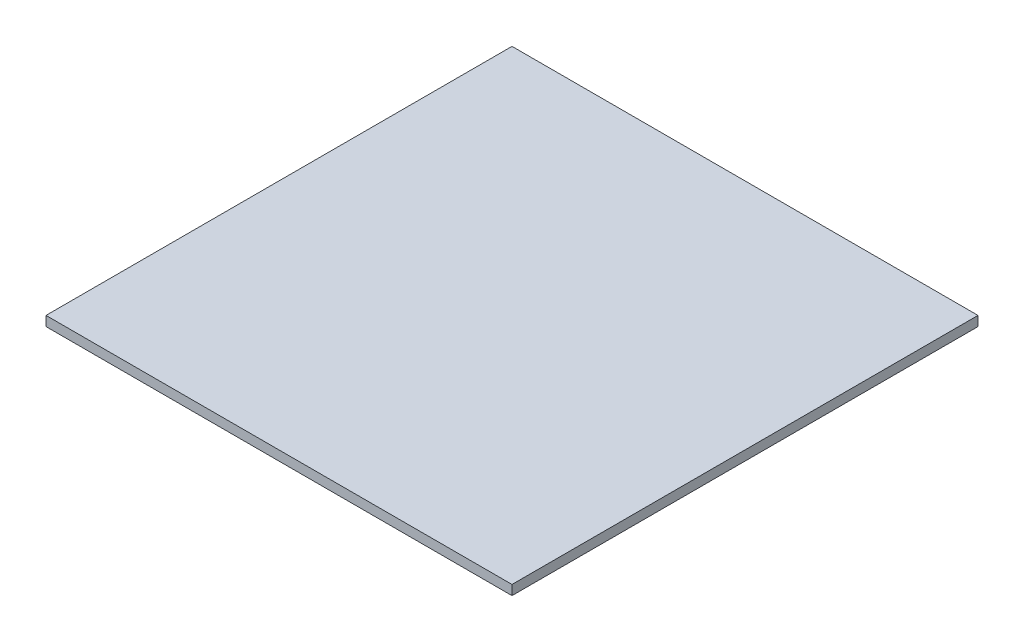
ISO-10303-21;
HEADER;
FILE_DESCRIPTION(('STEP AP214'),'2;1');
FILE_NAME('part.step','',(''),(''),'','','');
FILE_SCHEMA(('AUTOMOTIVE_DESIGN { 1 0 10303 214 1 1 1 1 }'));
ENDSEC;
DATA;
#1=APPLICATION_CONTEXT('core data for automotive mechanical design processes');
#2=APPLICATION_PROTOCOL_DEFINITION('international standard','automotive_design',2000,#1);
#3=PRODUCT_CONTEXT('',#1,'mechanical');
#4=PRODUCT('Part','Part','',(#3));
#5=PRODUCT_RELATED_PRODUCT_CATEGORY('part','',(#4));
#6=PRODUCT_DEFINITION_FORMATION('','',#4);
#7=PRODUCT_DEFINITION_CONTEXT('part definition',#1,'design');
#8=PRODUCT_DEFINITION('design','',#6,#7);
#9=PRODUCT_DEFINITION_SHAPE('','',#8);
#10=(LENGTH_UNIT() NAMED_UNIT(*) SI_UNIT(.MILLI.,.METRE.));
#11=(NAMED_UNIT(*) PLANE_ANGLE_UNIT() SI_UNIT($,.RADIAN.));
#12=(NAMED_UNIT(*) SI_UNIT($,.STERADIAN.) SOLID_ANGLE_UNIT());
#13=UNCERTAINTY_MEASURE_WITH_UNIT(LENGTH_MEASURE(1.E-05),#10,'distance_accuracy_value','');
#14=(GEOMETRIC_REPRESENTATION_CONTEXT(3) GLOBAL_UNCERTAINTY_ASSIGNED_CONTEXT((#13)) GLOBAL_UNIT_ASSIGNED_CONTEXT((#10,
#11,#12)) REPRESENTATION_CONTEXT('',''));
#15=CARTESIAN_POINT('',(0.,0.,0.));
#16=DIRECTION('',(0.,0.,1.));
#17=DIRECTION('',(1.,0.,0.));
#18=AXIS2_PLACEMENT_3D('',#15,#16,#17);
#19=CARTESIAN_POINT('',(152.4,3.175,152.4));
#20=DIRECTION('',(-1.,0.,0.));
#21=DIRECTION('',(0.,0.,1.));
#22=AXIS2_PLACEMENT_3D('',#19,#20,#21);
#23=PLANE('',#22);
#24=DIRECTION('',(0.,0.,-1.));
#25=VECTOR('',#24,1.);
#26=CARTESIAN_POINT('',(152.4,-3.175,152.4));
#27=LINE('',#26,#25);
#28=CARTESIAN_POINT('',(152.4,-3.175,152.4));
#29=VERTEX_POINT('',#28);
#30=CARTESIAN_POINT('',(152.4,-3.175,-152.4));
#31=VERTEX_POINT('',#30);
#32=EDGE_CURVE('E96',#29,#31,#27,.T.);
#33=ORIENTED_EDGE('',*,*,#32,.T.);
#34=DIRECTION('',(0.,-1.,0.));
#35=VECTOR('',#34,1.);
#36=CARTESIAN_POINT('',(152.4,3.175,-152.4));
#37=LINE('',#36,#35);
#38=CARTESIAN_POINT('',(152.4,3.175,-152.4));
#39=VERTEX_POINT('',#38);
#40=EDGE_CURVE('E11',#39,#31,#37,.T.);
#41=ORIENTED_EDGE('',*,*,#40,.F.);
#42=DIRECTION('',(0.,0.,-1.));
#43=VECTOR('',#42,1.);
#44=CARTESIAN_POINT('',(152.4,3.175,152.4));
#45=LINE('',#44,#43);
#46=CARTESIAN_POINT('',(152.4,3.175,152.4));
#47=VERTEX_POINT('',#46);
#48=EDGE_CURVE('E84',#47,#39,#45,.T.);
#49=ORIENTED_EDGE('',*,*,#48,.F.);
#50=DIRECTION('',(0.,-1.,0.));
#51=VECTOR('',#50,1.);
#52=CARTESIAN_POINT('',(152.4,3.175,152.4));
#53=LINE('',#52,#51);
#54=EDGE_CURVE('E92',#47,#29,#53,.T.);
#55=ORIENTED_EDGE('',*,*,#54,.T.);
#56=EDGE_LOOP('',(#33,#41,#49,#55));
#57=FACE_BOUND('',#56,.T.);
#58=ADVANCED_FACE('F33',(#57),#23,.F.);
#59=CARTESIAN_POINT('',(-152.4,3.175,-152.4));
#60=DIRECTION('',(0.,0.,1.));
#61=DIRECTION('',(1.,0.,0.));
#62=AXIS2_PLACEMENT_3D('',#59,#60,#61);
#63=PLANE('',#62);
#64=DIRECTION('',(-1.,0.,0.));
#65=VECTOR('',#64,1.);
#66=CARTESIAN_POINT('',(-152.4,-3.175,-152.4));
#67=LINE('',#66,#65);
#68=CARTESIAN_POINT('',(-152.4,-3.175,-152.4));
#69=VERTEX_POINT('',#68);
#70=EDGE_CURVE('E88',#31,#69,#67,.T.);
#71=ORIENTED_EDGE('',*,*,#70,.T.);
#72=DIRECTION('',(0.,-1.,0.));
#73=VECTOR('',#72,1.);
#74=CARTESIAN_POINT('',(-152.4,3.175,-152.4));
#75=LINE('',#74,#73);
#76=CARTESIAN_POINT('',(-152.4,3.175,-152.4));
#77=VERTEX_POINT('',#76);
#78=EDGE_CURVE('E41',#77,#69,#75,.T.);
#79=ORIENTED_EDGE('',*,*,#78,.F.);
#80=DIRECTION('',(-1.,0.,0.));
#81=VECTOR('',#80,1.);
#82=CARTESIAN_POINT('',(-152.4,3.175,-152.4));
#83=LINE('',#82,#81);
#84=EDGE_CURVE('E79',#39,#77,#83,.T.);
#85=ORIENTED_EDGE('',*,*,#84,.F.);
#86=ORIENTED_EDGE('',*,*,#40,.T.);
#87=EDGE_LOOP('',(#71,#79,#85,#86));
#88=FACE_BOUND('',#87,.T.);
#89=ADVANCED_FACE('F87',(#88),#63,.F.);
#90=CARTESIAN_POINT('',(-152.4,3.175,152.4));
#91=DIRECTION('',(1.,0.,0.));
#92=DIRECTION('',(0.,0.,-1.));
#93=AXIS2_PLACEMENT_3D('',#90,#91,#92);
#94=PLANE('',#93);
#95=DIRECTION('',(0.,0.,1.));
#96=VECTOR('',#95,1.);
#97=CARTESIAN_POINT('',(-152.4,-3.175,152.4));
#98=LINE('',#97,#96);
#99=CARTESIAN_POINT('',(-152.4,-3.175,152.4));
#100=VERTEX_POINT('',#99);
#101=EDGE_CURVE('E66',#69,#100,#98,.T.);
#102=ORIENTED_EDGE('',*,*,#101,.T.);
#103=DIRECTION('',(0.,-1.,0.));
#104=VECTOR('',#103,1.);
#105=CARTESIAN_POINT('',(-152.4,3.175,152.4));
#106=LINE('',#105,#104);
#107=CARTESIAN_POINT('',(-152.4,3.175,152.4));
#108=VERTEX_POINT('',#107);
#109=EDGE_CURVE('E89',#108,#100,#106,.T.);
#110=ORIENTED_EDGE('',*,*,#109,.F.);
#111=DIRECTION('',(0.,0.,1.));
#112=VECTOR('',#111,1.);
#113=CARTESIAN_POINT('',(-152.4,3.175,152.4));
#114=LINE('',#113,#112);
#115=EDGE_CURVE('E82',#77,#108,#114,.T.);
#116=ORIENTED_EDGE('',*,*,#115,.F.);
#117=ORIENTED_EDGE('',*,*,#78,.T.);
#118=EDGE_LOOP('',(#102,#110,#116,#117));
#119=FACE_BOUND('',#118,.T.);
#120=ADVANCED_FACE('F90',(#119),#94,.F.);
#121=CARTESIAN_POINT('',(-152.4,3.175,152.4));
#122=DIRECTION('',(0.,0.,-1.));
#123=DIRECTION('',(-1.,0.,0.));
#124=AXIS2_PLACEMENT_3D('',#121,#122,#123);
#125=PLANE('',#124);
#126=DIRECTION('',(1.,0.,0.));
#127=VECTOR('',#126,1.);
#128=CARTESIAN_POINT('',(-152.4,-3.175,152.4));
#129=LINE('',#128,#127);
#130=EDGE_CURVE('E72',#100,#29,#129,.T.);
#131=ORIENTED_EDGE('',*,*,#130,.T.);
#132=ORIENTED_EDGE('',*,*,#54,.F.);
#133=DIRECTION('',(1.,0.,0.));
#134=VECTOR('',#133,1.);
#135=CARTESIAN_POINT('',(-152.4,3.175,152.4));
#136=LINE('',#135,#134);
#137=EDGE_CURVE('E49',#108,#47,#136,.T.);
#138=ORIENTED_EDGE('',*,*,#137,.F.);
#139=ORIENTED_EDGE('',*,*,#109,.T.);
#140=EDGE_LOOP('',(#131,#132,#138,#139));
#141=FACE_BOUND('',#140,.T.);
#142=ADVANCED_FACE('F103',(#141),#125,.F.);
#143=CARTESIAN_POINT('',(0.,3.175,0.));
#144=DIRECTION('',(0.,-1.,0.));
#145=DIRECTION('',(0.,0.,-1.));
#146=AXIS2_PLACEMENT_3D('',#143,#144,#145);
#147=PLANE('',#146);
#148=ORIENTED_EDGE('',*,*,#48,.T.);
#149=ORIENTED_EDGE('',*,*,#84,.T.);
#150=ORIENTED_EDGE('',*,*,#115,.T.);
#151=ORIENTED_EDGE('',*,*,#137,.T.);
#152=EDGE_LOOP('',(#148,#149,#150,#151));
#153=FACE_BOUND('',#152,.T.);
#154=ADVANCED_FACE('F80',(#153),#147,.F.);
#155=CARTESIAN_POINT('',(0.,-3.175,0.));
#156=DIRECTION('',(0.,-1.,0.));
#157=DIRECTION('',(0.,0.,-1.));
#158=AXIS2_PLACEMENT_3D('',#155,#156,#157);
#159=PLANE('',#158);
#160=ORIENTED_EDGE('',*,*,#32,.F.);
#161=ORIENTED_EDGE('',*,*,#130,.F.);
#162=ORIENTED_EDGE('',*,*,#101,.F.);
#163=ORIENTED_EDGE('',*,*,#70,.F.);
#164=EDGE_LOOP('',(#160,#161,#162,#163));
#165=FACE_BOUND('',#164,.T.);
#166=ADVANCED_FACE('F106',(#165),#159,.T.);
#167=CLOSED_SHELL('',(#58,#89,#120,#142,#154,#166));
#168=MANIFOLD_SOLID_BREP('B2',#167);
#169=ADVANCED_BREP_SHAPE_REPRESENTATION('',(#18,#168),#14);
#170=SHAPE_DEFINITION_REPRESENTATION(#9,#169);
ENDSEC;
END-ISO-10303-21;
